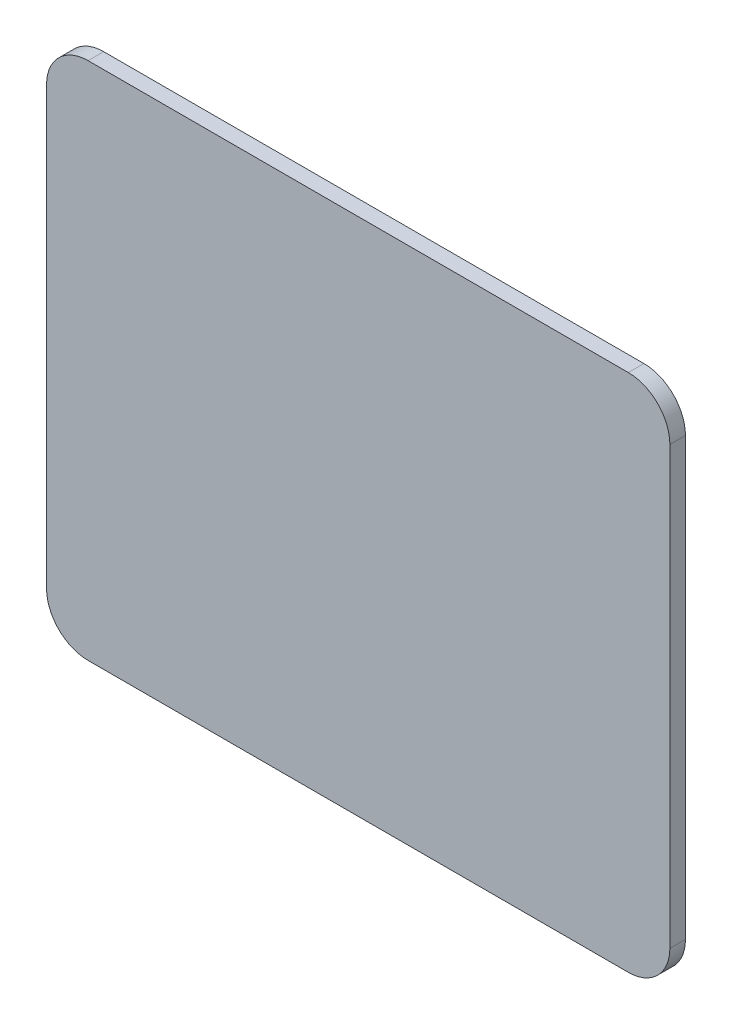
ISO-10303-21;
HEADER;
FILE_DESCRIPTION(('STEP AP214'),'2;1');
FILE_NAME('part.step','',(''),(''),'','','');
FILE_SCHEMA(('AUTOMOTIVE_DESIGN { 1 0 10303 214 1 1 1 1 }'));
ENDSEC;
DATA;
#1=APPLICATION_CONTEXT('core data for automotive mechanical design processes');
#2=APPLICATION_PROTOCOL_DEFINITION('international standard','automotive_design',2000,#1);
#3=PRODUCT_CONTEXT('',#1,'mechanical');
#4=PRODUCT('Part','Part','',(#3));
#5=PRODUCT_RELATED_PRODUCT_CATEGORY('part','',(#4));
#6=PRODUCT_DEFINITION_FORMATION('','',#4);
#7=PRODUCT_DEFINITION_CONTEXT('part definition',#1,'design');
#8=PRODUCT_DEFINITION('design','',#6,#7);
#9=PRODUCT_DEFINITION_SHAPE('','',#8);
#10=(LENGTH_UNIT() NAMED_UNIT(*) SI_UNIT(.MILLI.,.METRE.));
#11=(NAMED_UNIT(*) PLANE_ANGLE_UNIT() SI_UNIT($,.RADIAN.));
#12=(NAMED_UNIT(*) SI_UNIT($,.STERADIAN.) SOLID_ANGLE_UNIT());
#13=UNCERTAINTY_MEASURE_WITH_UNIT(LENGTH_MEASURE(1.E-05),#10,'distance_accuracy_value','');
#14=(GEOMETRIC_REPRESENTATION_CONTEXT(3) GLOBAL_UNCERTAINTY_ASSIGNED_CONTEXT((#13)) GLOBAL_UNIT_ASSIGNED_CONTEXT((#10,
#11,#12)) REPRESENTATION_CONTEXT('',''));
#15=CARTESIAN_POINT('',(0.,0.,0.));
#16=DIRECTION('',(0.,0.,1.));
#17=DIRECTION('',(1.,0.,0.));
#18=AXIS2_PLACEMENT_3D('',#15,#16,#17);
#19=CARTESIAN_POINT('',(-64.122052125993,155.000000000059,-3.));
#20=DIRECTION('',(0.,0.,1.));
#21=DIRECTION('',(1.,0.,0.));
#22=AXIS2_PLACEMENT_3D('',#19,#20,#21);
#23=CYLINDRICAL_SURFACE('',#22,8.00000000000001);
#24=CARTESIAN_POINT('',(-64.122052125993,155.000000000059,0.));
#25=DIRECTION('',(0.,0.,1.));
#26=DIRECTION('',(1.,0.,0.));
#27=AXIS2_PLACEMENT_3D('',#24,#25,#26);
#28=CIRCLE('',#27,8.00000000000001);
#29=CARTESIAN_POINT('',(-64.122052125993,163.000000000059,0.));
#30=VERTEX_POINT('',#29);
#31=CARTESIAN_POINT('',(-72.122052125993,155.000000000059,0.));
#32=VERTEX_POINT('',#31);
#33=EDGE_CURVE('E130',#30,#32,#28,.T.);
#34=ORIENTED_EDGE('',*,*,#33,.F.);
#35=DIRECTION('',(0.,0.,1.));
#36=VECTOR('',#35,1.);
#37=CARTESIAN_POINT('',(-64.122052125993,163.000000000059,-3.));
#38=LINE('',#37,#36);
#39=CARTESIAN_POINT('',(-64.122052125993,163.000000000059,-3.));
#40=VERTEX_POINT('',#39);
#41=EDGE_CURVE('E11',#40,#30,#38,.T.);
#42=ORIENTED_EDGE('',*,*,#41,.F.);
#43=CARTESIAN_POINT('',(-64.122052125993,155.000000000059,-3.));
#44=DIRECTION('',(0.,0.,1.));
#45=DIRECTION('',(1.,0.,0.));
#46=AXIS2_PLACEMENT_3D('',#43,#44,#45);
#47=CIRCLE('',#46,8.00000000000001);
#48=CARTESIAN_POINT('',(-72.122052125993,155.000000000059,-3.));
#49=VERTEX_POINT('',#48);
#50=EDGE_CURVE('E150',#40,#49,#47,.T.);
#51=ORIENTED_EDGE('',*,*,#50,.T.);
#52=DIRECTION('',(0.,0.,1.));
#53=VECTOR('',#52,1.);
#54=CARTESIAN_POINT('',(-72.122052125993,155.000000000059,-3.));
#55=LINE('',#54,#53);
#56=EDGE_CURVE('E36',#49,#32,#55,.T.);
#57=ORIENTED_EDGE('',*,*,#56,.T.);
#58=EDGE_LOOP('',(#34,#42,#51,#57));
#59=FACE_BOUND('',#58,.T.);
#60=ADVANCED_FACE('F33',(#59),#23,.T.);
#61=CARTESIAN_POINT('',(39.877947874007,163.000000000059,-3.));
#62=DIRECTION('',(0.,1.,0.));
#63=DIRECTION('',(0.,0.,1.));
#64=AXIS2_PLACEMENT_3D('',#61,#62,#63);
#65=PLANE('',#64);
#66=DIRECTION('',(-1.,0.,0.));
#67=VECTOR('',#66,1.);
#68=CARTESIAN_POINT('',(39.877947874007,163.000000000059,0.));
#69=LINE('',#68,#67);
#70=CARTESIAN_POINT('',(39.877947874007,163.000000000059,0.));
#71=VERTEX_POINT('',#70);
#72=EDGE_CURVE('E148',#71,#30,#69,.T.);
#73=ORIENTED_EDGE('',*,*,#72,.F.);
#74=DIRECTION('',(0.,0.,1.));
#75=VECTOR('',#74,1.);
#76=CARTESIAN_POINT('',(39.877947874007,163.000000000059,-3.));
#77=LINE('',#76,#75);
#78=CARTESIAN_POINT('',(39.877947874007,163.000000000059,-3.));
#79=VERTEX_POINT('',#78);
#80=EDGE_CURVE('E42',#79,#71,#77,.T.);
#81=ORIENTED_EDGE('',*,*,#80,.F.);
#82=DIRECTION('',(-1.,0.,0.));
#83=VECTOR('',#82,1.);
#84=CARTESIAN_POINT('',(39.877947874007,163.000000000059,-3.));
#85=LINE('',#84,#83);
#86=EDGE_CURVE('E120',#79,#40,#85,.T.);
#87=ORIENTED_EDGE('',*,*,#86,.T.);
#88=ORIENTED_EDGE('',*,*,#41,.T.);
#89=EDGE_LOOP('',(#73,#81,#87,#88));
#90=FACE_BOUND('',#89,.T.);
#91=ADVANCED_FACE('F162',(#90),#65,.T.);
#92=CARTESIAN_POINT('',(39.877947874007,155.000000000059,-3.));
#93=DIRECTION('',(0.,0.,1.));
#94=DIRECTION('',(1.,0.,0.));
#95=AXIS2_PLACEMENT_3D('',#92,#93,#94);
#96=CYLINDRICAL_SURFACE('',#95,8.);
#97=CARTESIAN_POINT('',(39.877947874007,155.000000000059,0.));
#98=DIRECTION('',(0.,0.,1.));
#99=DIRECTION('',(1.,0.,0.));
#100=AXIS2_PLACEMENT_3D('',#97,#98,#99);
#101=CIRCLE('',#100,8.);
#102=CARTESIAN_POINT('',(47.877947874007,155.000000000059,0.));
#103=VERTEX_POINT('',#102);
#104=EDGE_CURVE('E107',#103,#71,#101,.T.);
#105=ORIENTED_EDGE('',*,*,#104,.F.);
#106=DIRECTION('',(0.,0.,1.));
#107=VECTOR('',#106,1.);
#108=CARTESIAN_POINT('',(47.877947874007,155.000000000059,-3.));
#109=LINE('',#108,#107);
#110=CARTESIAN_POINT('',(47.877947874007,155.000000000059,-3.));
#111=VERTEX_POINT('',#110);
#112=EDGE_CURVE('E102',#111,#103,#109,.T.);
#113=ORIENTED_EDGE('',*,*,#112,.F.);
#114=CARTESIAN_POINT('',(39.877947874007,155.000000000059,-3.));
#115=DIRECTION('',(0.,0.,1.));
#116=DIRECTION('',(1.,0.,0.));
#117=AXIS2_PLACEMENT_3D('',#114,#115,#116);
#118=CIRCLE('',#117,8.);
#119=EDGE_CURVE('E105',#111,#79,#118,.T.);
#120=ORIENTED_EDGE('',*,*,#119,.T.);
#121=ORIENTED_EDGE('',*,*,#80,.T.);
#122=EDGE_LOOP('',(#105,#113,#120,#121));
#123=FACE_BOUND('',#122,.T.);
#124=ADVANCED_FACE('F104',(#123),#96,.T.);
#125=CARTESIAN_POINT('',(47.877947874007,71.0000000000591,-3.));
#126=DIRECTION('',(1.,0.,0.));
#127=DIRECTION('',(0.,0.,-1.));
#128=AXIS2_PLACEMENT_3D('',#125,#126,#127);
#129=PLANE('',#128);
#130=DIRECTION('',(0.,1.,0.));
#131=VECTOR('',#130,1.);
#132=CARTESIAN_POINT('',(47.877947874007,71.0000000000591,0.));
#133=LINE('',#132,#131);
#134=CARTESIAN_POINT('',(47.877947874007,71.0000000000591,0.));
#135=VERTEX_POINT('',#134);
#136=EDGE_CURVE('E145',#135,#103,#133,.T.);
#137=ORIENTED_EDGE('',*,*,#136,.F.);
#138=DIRECTION('',(0.,0.,1.));
#139=VECTOR('',#138,1.);
#140=CARTESIAN_POINT('',(47.877947874007,71.0000000000591,-3.));
#141=LINE('',#140,#139);
#142=CARTESIAN_POINT('',(47.877947874007,71.0000000000591,-3.));
#143=VERTEX_POINT('',#142);
#144=EDGE_CURVE('E112',#143,#135,#141,.T.);
#145=ORIENTED_EDGE('',*,*,#144,.F.);
#146=DIRECTION('',(0.,1.,0.));
#147=VECTOR('',#146,1.);
#148=CARTESIAN_POINT('',(47.877947874007,71.0000000000591,-3.));
#149=LINE('',#148,#147);
#150=EDGE_CURVE('E118',#143,#111,#149,.T.);
#151=ORIENTED_EDGE('',*,*,#150,.T.);
#152=ORIENTED_EDGE('',*,*,#112,.T.);
#153=EDGE_LOOP('',(#137,#145,#151,#152));
#154=FACE_BOUND('',#153,.T.);
#155=ADVANCED_FACE('F122',(#154),#129,.T.);
#156=CARTESIAN_POINT('',(39.877947874007,71.0000000000591,-3.));
#157=DIRECTION('',(0.,0.,1.));
#158=DIRECTION('',(1.,0.,0.));
#159=AXIS2_PLACEMENT_3D('',#156,#157,#158);
#160=CYLINDRICAL_SURFACE('',#159,8.00000000000001);
#161=CARTESIAN_POINT('',(39.877947874007,71.0000000000591,0.));
#162=DIRECTION('',(0.,0.,1.));
#163=DIRECTION('',(1.,0.,0.));
#164=AXIS2_PLACEMENT_3D('',#161,#162,#163);
#165=CIRCLE('',#164,8.00000000000001);
#166=CARTESIAN_POINT('',(39.877947874007,63.0000000000591,0.));
#167=VERTEX_POINT('',#166);
#168=EDGE_CURVE('E142',#167,#135,#165,.T.);
#169=ORIENTED_EDGE('',*,*,#168,.F.);
#170=DIRECTION('',(0.,0.,1.));
#171=VECTOR('',#170,1.);
#172=CARTESIAN_POINT('',(39.877947874007,63.0000000000591,-3.));
#173=LINE('',#172,#171);
#174=CARTESIAN_POINT('',(39.877947874007,63.0000000000591,-3.));
#175=VERTEX_POINT('',#174);
#176=EDGE_CURVE('E154',#175,#167,#173,.T.);
#177=ORIENTED_EDGE('',*,*,#176,.F.);
#178=CARTESIAN_POINT('',(39.877947874007,71.0000000000591,-3.));
#179=DIRECTION('',(0.,0.,1.));
#180=DIRECTION('',(1.,0.,0.));
#181=AXIS2_PLACEMENT_3D('',#178,#179,#180);
#182=CIRCLE('',#181,8.00000000000001);
#183=EDGE_CURVE('E123',#175,#143,#182,.T.);
#184=ORIENTED_EDGE('',*,*,#183,.T.);
#185=ORIENTED_EDGE('',*,*,#144,.T.);
#186=EDGE_LOOP('',(#169,#177,#184,#185));
#187=FACE_BOUND('',#186,.T.);
#188=ADVANCED_FACE('F175',(#187),#160,.T.);
#189=CARTESIAN_POINT('',(-64.122052125993,63.0000000000591,-3.));
#190=DIRECTION('',(0.,-1.,0.));
#191=DIRECTION('',(0.,0.,-1.));
#192=AXIS2_PLACEMENT_3D('',#189,#190,#191);
#193=PLANE('',#192);
#194=DIRECTION('',(1.,0.,0.));
#195=VECTOR('',#194,1.);
#196=CARTESIAN_POINT('',(-64.122052125993,63.0000000000591,0.));
#197=LINE('',#196,#195);
#198=CARTESIAN_POINT('',(-64.122052125993,63.0000000000591,0.));
#199=VERTEX_POINT('',#198);
#200=EDGE_CURVE('E139',#199,#167,#197,.T.);
#201=ORIENTED_EDGE('',*,*,#200,.F.);
#202=DIRECTION('',(0.,0.,1.));
#203=VECTOR('',#202,1.);
#204=CARTESIAN_POINT('',(-64.122052125993,63.0000000000591,-3.));
#205=LINE('',#204,#203);
#206=CARTESIAN_POINT('',(-64.122052125993,63.0000000000591,-3.));
#207=VERTEX_POINT('',#206);
#208=EDGE_CURVE('E156',#207,#199,#205,.T.);
#209=ORIENTED_EDGE('',*,*,#208,.F.);
#210=DIRECTION('',(1.,0.,0.));
#211=VECTOR('',#210,1.);
#212=CARTESIAN_POINT('',(-64.122052125993,63.0000000000591,-3.));
#213=LINE('',#212,#211);
#214=EDGE_CURVE('E125',#207,#175,#213,.T.);
#215=ORIENTED_EDGE('',*,*,#214,.T.);
#216=ORIENTED_EDGE('',*,*,#176,.T.);
#217=EDGE_LOOP('',(#201,#209,#215,#216));
#218=FACE_BOUND('',#217,.T.);
#219=ADVANCED_FACE('F178',(#218),#193,.T.);
#220=CARTESIAN_POINT('',(-64.122052125993,71.0000000000591,-3.));
#221=DIRECTION('',(0.,0.,1.));
#222=DIRECTION('',(1.,0.,0.));
#223=AXIS2_PLACEMENT_3D('',#220,#221,#222);
#224=CYLINDRICAL_SURFACE('',#223,8.00000000000001);
#225=CARTESIAN_POINT('',(-64.122052125993,71.0000000000591,0.));
#226=DIRECTION('',(0.,0.,1.));
#227=DIRECTION('',(1.,0.,0.));
#228=AXIS2_PLACEMENT_3D('',#225,#226,#227);
#229=CIRCLE('',#228,8.00000000000001);
#230=CARTESIAN_POINT('',(-72.122052125993,71.0000000000591,0.));
#231=VERTEX_POINT('',#230);
#232=EDGE_CURVE('E136',#231,#199,#229,.T.);
#233=ORIENTED_EDGE('',*,*,#232,.F.);
#234=DIRECTION('',(0.,0.,1.));
#235=VECTOR('',#234,1.);
#236=CARTESIAN_POINT('',(-72.122052125993,71.0000000000591,-3.));
#237=LINE('',#236,#235);
#238=CARTESIAN_POINT('',(-72.122052125993,71.0000000000591,-3.));
#239=VERTEX_POINT('',#238);
#240=EDGE_CURVE('E157',#239,#231,#237,.T.);
#241=ORIENTED_EDGE('',*,*,#240,.F.);
#242=CARTESIAN_POINT('',(-64.122052125993,71.0000000000591,-3.));
#243=DIRECTION('',(0.,0.,1.));
#244=DIRECTION('',(1.,0.,0.));
#245=AXIS2_PLACEMENT_3D('',#242,#243,#244);
#246=CIRCLE('',#245,8.00000000000001);
#247=EDGE_CURVE('E253',#239,#207,#246,.T.);
#248=ORIENTED_EDGE('',*,*,#247,.T.);
#249=ORIENTED_EDGE('',*,*,#208,.T.);
#250=EDGE_LOOP('',(#233,#241,#248,#249));
#251=FACE_BOUND('',#250,.T.);
#252=ADVANCED_FACE('F182',(#251),#224,.T.);
#253=CARTESIAN_POINT('',(-72.122052125993,155.000000000059,-3.));
#254=DIRECTION('',(-1.,0.,0.));
#255=DIRECTION('',(0.,0.,1.));
#256=AXIS2_PLACEMENT_3D('',#253,#254,#255);
#257=PLANE('',#256);
#258=DIRECTION('',(0.,-1.,0.));
#259=VECTOR('',#258,1.);
#260=CARTESIAN_POINT('',(-72.122052125993,155.000000000059,0.));
#261=LINE('',#260,#259);
#262=EDGE_CURVE('E133',#32,#231,#261,.T.);
#263=ORIENTED_EDGE('',*,*,#262,.F.);
#264=ORIENTED_EDGE('',*,*,#56,.F.);
#265=DIRECTION('',(0.,-1.,0.));
#266=VECTOR('',#265,1.);
#267=CARTESIAN_POINT('',(-72.122052125993,155.000000000059,-3.));
#268=LINE('',#267,#266);
#269=EDGE_CURVE('E254',#49,#239,#268,.T.);
#270=ORIENTED_EDGE('',*,*,#269,.T.);
#271=ORIENTED_EDGE('',*,*,#240,.T.);
#272=EDGE_LOOP('',(#263,#264,#270,#271));
#273=FACE_BOUND('',#272,.T.);
#274=ADVANCED_FACE('F159',(#273),#257,.T.);
#275=CARTESIAN_POINT('',(-64.122052125993,155.000000000059,-3.));
#276=DIRECTION('',(0.,0.,1.));
#277=DIRECTION('',(1.,0.,0.));
#278=AXIS2_PLACEMENT_3D('',#275,#276,#277);
#279=PLANE('',#278);
#280=ORIENTED_EDGE('',*,*,#50,.F.);
#281=ORIENTED_EDGE('',*,*,#86,.F.);
#282=ORIENTED_EDGE('',*,*,#119,.F.);
#283=ORIENTED_EDGE('',*,*,#150,.F.);
#284=ORIENTED_EDGE('',*,*,#183,.F.);
#285=ORIENTED_EDGE('',*,*,#214,.F.);
#286=ORIENTED_EDGE('',*,*,#247,.F.);
#287=ORIENTED_EDGE('',*,*,#269,.F.);
#288=EDGE_LOOP('',(#280,#281,#282,#283,#284,#285,#286,#287));
#289=FACE_BOUND('',#288,.T.);
#290=ADVANCED_FACE('F116',(#289),#279,.F.);
#291=CARTESIAN_POINT('',(-64.122052125993,155.000000000059,0.));
#292=DIRECTION('',(0.,0.,1.));
#293=DIRECTION('',(1.,0.,0.));
#294=AXIS2_PLACEMENT_3D('',#291,#292,#293);
#295=PLANE('',#294);
#296=ORIENTED_EDGE('',*,*,#33,.T.);
#297=ORIENTED_EDGE('',*,*,#262,.T.);
#298=ORIENTED_EDGE('',*,*,#232,.T.);
#299=ORIENTED_EDGE('',*,*,#200,.T.);
#300=ORIENTED_EDGE('',*,*,#168,.T.);
#301=ORIENTED_EDGE('',*,*,#136,.T.);
#302=ORIENTED_EDGE('',*,*,#104,.T.);
#303=ORIENTED_EDGE('',*,*,#72,.T.);
#304=EDGE_LOOP('',(#296,#297,#298,#299,#300,#301,#302,#303));
#305=FACE_BOUND('',#304,.T.);
#306=ADVANCED_FACE('F161',(#305),#295,.T.);
#307=CLOSED_SHELL('',(#60,#91,#124,#155,#188,#219,#252,#274,#290,#306));
#308=MANIFOLD_SOLID_BREP('B2',#307);
#309=ADVANCED_BREP_SHAPE_REPRESENTATION('',(#18,#308),#14);
#310=SHAPE_DEFINITION_REPRESENTATION(#9,#309);
ENDSEC;
END-ISO-10303-21;
